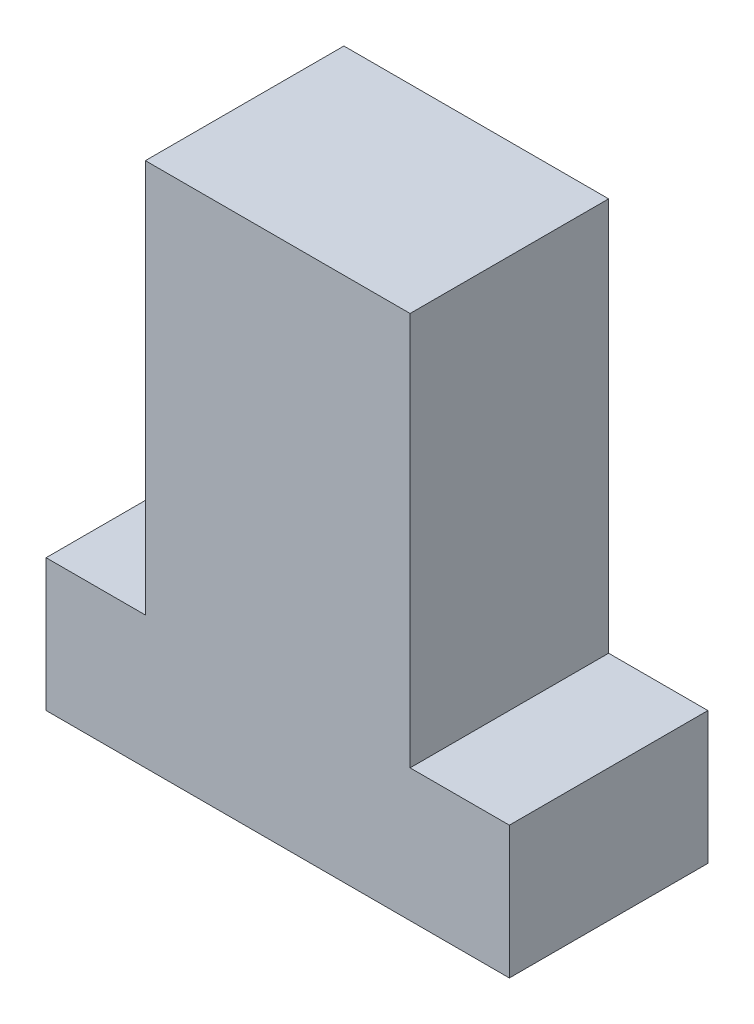
ISO-10303-21;
HEADER;
FILE_DESCRIPTION(('STEP AP214'),'2;1');
FILE_NAME('part.step','',(''),(''),'','','');
FILE_SCHEMA(('AUTOMOTIVE_DESIGN { 1 0 10303 214 1 1 1 1 }'));
ENDSEC;
DATA;
#1=APPLICATION_CONTEXT('core data for automotive mechanical design processes');
#2=APPLICATION_PROTOCOL_DEFINITION('international standard','automotive_design',2000,#1);
#3=PRODUCT_CONTEXT('',#1,'mechanical');
#4=PRODUCT('Part','Part','',(#3));
#5=PRODUCT_RELATED_PRODUCT_CATEGORY('part','',(#4));
#6=PRODUCT_DEFINITION_FORMATION('','',#4);
#7=PRODUCT_DEFINITION_CONTEXT('part definition',#1,'design');
#8=PRODUCT_DEFINITION('design','',#6,#7);
#9=PRODUCT_DEFINITION_SHAPE('','',#8);
#10=(LENGTH_UNIT() NAMED_UNIT(*) SI_UNIT(.MILLI.,.METRE.));
#11=(NAMED_UNIT(*) PLANE_ANGLE_UNIT() SI_UNIT($,.RADIAN.));
#12=(NAMED_UNIT(*) SI_UNIT($,.STERADIAN.) SOLID_ANGLE_UNIT());
#13=UNCERTAINTY_MEASURE_WITH_UNIT(LENGTH_MEASURE(1.E-05),#10,'distance_accuracy_value','');
#14=(GEOMETRIC_REPRESENTATION_CONTEXT(3) GLOBAL_UNCERTAINTY_ASSIGNED_CONTEXT((#13)) GLOBAL_UNIT_ASSIGNED_CONTEXT((#10,
#11,#12)) REPRESENTATION_CONTEXT('',''));
#15=CARTESIAN_POINT('',(0.,0.,0.));
#16=DIRECTION('',(0.,0.,1.));
#17=DIRECTION('',(1.,0.,0.));
#18=AXIS2_PLACEMENT_3D('',#15,#16,#17);
#19=CARTESIAN_POINT('',(-20.,0.,30.));
#20=DIRECTION('',(-1.,0.,0.));
#21=DIRECTION('',(0.,0.,1.));
#22=AXIS2_PLACEMENT_3D('',#19,#20,#21);
#23=PLANE('',#22);
#24=DIRECTION('',(0.,1.,0.));
#25=VECTOR('',#24,1.);
#26=CARTESIAN_POINT('',(-20.,0.,0.));
#27=LINE('',#26,#25);
#28=CARTESIAN_POINT('',(-20.,9.99999999999999,0.));
#29=VERTEX_POINT('',#28);
#30=CARTESIAN_POINT('',(-20.,69.46,0.));
#31=VERTEX_POINT('',#30);
#32=EDGE_CURVE('E181',#29,#31,#27,.T.);
#33=ORIENTED_EDGE('',*,*,#32,.F.);
#34=DIRECTION('',(0.,0.,-1.));
#35=VECTOR('',#34,1.);
#36=CARTESIAN_POINT('',(-20.,9.99999999999999,30.));
#37=LINE('',#36,#35);
#38=CARTESIAN_POINT('',(-20.,9.99999999999999,30.));
#39=VERTEX_POINT('',#38);
#40=EDGE_CURVE('E11',#39,#29,#37,.T.);
#41=ORIENTED_EDGE('',*,*,#40,.F.);
#42=DIRECTION('',(0.,1.,0.));
#43=VECTOR('',#42,1.);
#44=CARTESIAN_POINT('',(-20.,0.,30.));
#45=LINE('',#44,#43);
#46=CARTESIAN_POINT('',(-20.,69.46,30.));
#47=VERTEX_POINT('',#46);
#48=EDGE_CURVE('E141',#39,#47,#45,.T.);
#49=ORIENTED_EDGE('',*,*,#48,.T.);
#50=DIRECTION('',(0.,0.,-1.));
#51=VECTOR('',#50,1.);
#52=CARTESIAN_POINT('',(-20.,69.46,30.));
#53=LINE('',#52,#51);
#54=EDGE_CURVE('E56',#47,#31,#53,.T.);
#55=ORIENTED_EDGE('',*,*,#54,.T.);
#56=EDGE_LOOP('',(#33,#41,#49,#55));
#57=FACE_BOUND('',#56,.T.);
#58=ADVANCED_FACE('F39',(#57),#23,.T.);
#59=CARTESIAN_POINT('',(0.,9.99999999999999,30.));
#60=DIRECTION('',(0.,1.,0.));
#61=DIRECTION('',(0.,0.,1.));
#62=AXIS2_PLACEMENT_3D('',#59,#60,#61);
#63=PLANE('',#62);
#64=DIRECTION('',(1.,0.,0.));
#65=VECTOR('',#64,1.);
#66=CARTESIAN_POINT('',(0.,9.99999999999999,0.));
#67=LINE('',#66,#65);
#68=CARTESIAN_POINT('',(-35.,9.99999999999999,0.));
#69=VERTEX_POINT('',#68);
#70=EDGE_CURVE('E178',#69,#29,#67,.T.);
#71=ORIENTED_EDGE('',*,*,#70,.F.);
#72=DIRECTION('',(0.,0.,-1.));
#73=VECTOR('',#72,1.);
#74=CARTESIAN_POINT('',(-35.,9.99999999999999,30.));
#75=LINE('',#74,#73);
#76=CARTESIAN_POINT('',(-35.,9.99999999999999,30.));
#77=VERTEX_POINT('',#76);
#78=EDGE_CURVE('E48',#77,#69,#75,.T.);
#79=ORIENTED_EDGE('',*,*,#78,.F.);
#80=DIRECTION('',(1.,0.,0.));
#81=VECTOR('',#80,1.);
#82=CARTESIAN_POINT('',(0.,9.99999999999999,30.));
#83=LINE('',#82,#81);
#84=EDGE_CURVE('E132',#77,#39,#83,.T.);
#85=ORIENTED_EDGE('',*,*,#84,.T.);
#86=ORIENTED_EDGE('',*,*,#40,.T.);
#87=EDGE_LOOP('',(#71,#79,#85,#86));
#88=FACE_BOUND('',#87,.T.);
#89=ADVANCED_FACE('F179',(#88),#63,.T.);
#90=CARTESIAN_POINT('',(-35.,0.,30.));
#91=DIRECTION('',(-1.,0.,0.));
#92=DIRECTION('',(0.,0.,1.));
#93=AXIS2_PLACEMENT_3D('',#90,#91,#92);
#94=PLANE('',#93);
#95=DIRECTION('',(0.,1.,0.));
#96=VECTOR('',#95,1.);
#97=CARTESIAN_POINT('',(-35.,0.,0.));
#98=LINE('',#97,#96);
#99=CARTESIAN_POINT('',(-35.,-10.,0.));
#100=VERTEX_POINT('',#99);
#101=EDGE_CURVE('E175',#100,#69,#98,.T.);
#102=ORIENTED_EDGE('',*,*,#101,.F.);
#103=DIRECTION('',(0.,0.,-1.));
#104=VECTOR('',#103,1.);
#105=CARTESIAN_POINT('',(-35.,-10.,30.));
#106=LINE('',#105,#104);
#107=CARTESIAN_POINT('',(-35.,-10.,30.));
#108=VERTEX_POINT('',#107);
#109=EDGE_CURVE('E167',#108,#100,#106,.T.);
#110=ORIENTED_EDGE('',*,*,#109,.F.);
#111=DIRECTION('',(0.,1.,0.));
#112=VECTOR('',#111,1.);
#113=CARTESIAN_POINT('',(-35.,0.,30.));
#114=LINE('',#113,#112);
#115=EDGE_CURVE('E140',#108,#77,#114,.T.);
#116=ORIENTED_EDGE('',*,*,#115,.T.);
#117=ORIENTED_EDGE('',*,*,#78,.T.);
#118=EDGE_LOOP('',(#102,#110,#116,#117));
#119=FACE_BOUND('',#118,.T.);
#120=ADVANCED_FACE('F173',(#119),#94,.T.);
#121=CARTESIAN_POINT('',(0.,-10.,30.));
#122=DIRECTION('',(0.,1.,0.));
#123=DIRECTION('',(0.,0.,1.));
#124=AXIS2_PLACEMENT_3D('',#121,#122,#123);
#125=PLANE('',#124);
#126=DIRECTION('',(1.,0.,0.));
#127=VECTOR('',#126,1.);
#128=CARTESIAN_POINT('',(0.,-10.,0.));
#129=LINE('',#128,#127);
#130=CARTESIAN_POINT('',(35.,-10.,0.));
#131=VERTEX_POINT('',#130);
#132=EDGE_CURVE('E186',#100,#131,#129,.T.);
#133=ORIENTED_EDGE('',*,*,#132,.T.);
#134=DIRECTION('',(0.,0.,-1.));
#135=VECTOR('',#134,1.);
#136=CARTESIAN_POINT('',(35.,-10.,30.));
#137=LINE('',#136,#135);
#138=CARTESIAN_POINT('',(35.,-10.,30.));
#139=VERTEX_POINT('',#138);
#140=EDGE_CURVE('E163',#139,#131,#137,.T.);
#141=ORIENTED_EDGE('',*,*,#140,.F.);
#142=DIRECTION('',(1.,0.,0.));
#143=VECTOR('',#142,1.);
#144=CARTESIAN_POINT('',(0.,-10.,30.));
#145=LINE('',#144,#143);
#146=EDGE_CURVE('E134',#108,#139,#145,.T.);
#147=ORIENTED_EDGE('',*,*,#146,.F.);
#148=ORIENTED_EDGE('',*,*,#109,.T.);
#149=EDGE_LOOP('',(#133,#141,#147,#148));
#150=FACE_BOUND('',#149,.T.);
#151=ADVANCED_FACE('F201',(#150),#125,.F.);
#152=CARTESIAN_POINT('',(35.,0.,30.));
#153=DIRECTION('',(-1.,0.,0.));
#154=DIRECTION('',(0.,0.,1.));
#155=AXIS2_PLACEMENT_3D('',#152,#153,#154);
#156=PLANE('',#155);
#157=DIRECTION('',(0.,1.,0.));
#158=VECTOR('',#157,1.);
#159=CARTESIAN_POINT('',(35.,0.,0.));
#160=LINE('',#159,#158);
#161=CARTESIAN_POINT('',(35.,9.99999999999999,0.));
#162=VERTEX_POINT('',#161);
#163=EDGE_CURVE('E190',#131,#162,#160,.T.);
#164=ORIENTED_EDGE('',*,*,#163,.T.);
#165=DIRECTION('',(0.,0.,-1.));
#166=VECTOR('',#165,1.);
#167=CARTESIAN_POINT('',(35.,9.99999999999999,30.));
#168=LINE('',#167,#166);
#169=CARTESIAN_POINT('',(35.,9.99999999999999,30.));
#170=VERTEX_POINT('',#169);
#171=EDGE_CURVE('E117',#170,#162,#168,.T.);
#172=ORIENTED_EDGE('',*,*,#171,.F.);
#173=DIRECTION('',(0.,1.,0.));
#174=VECTOR('',#173,1.);
#175=CARTESIAN_POINT('',(35.,0.,30.));
#176=LINE('',#175,#174);
#177=EDGE_CURVE('E128',#139,#170,#176,.T.);
#178=ORIENTED_EDGE('',*,*,#177,.F.);
#179=ORIENTED_EDGE('',*,*,#140,.T.);
#180=EDGE_LOOP('',(#164,#172,#178,#179));
#181=FACE_BOUND('',#180,.T.);
#182=ADVANCED_FACE('F197',(#181),#156,.F.);
#183=CARTESIAN_POINT('',(20.,9.99999999999999,0.));
#184=VERTEX_POINT('',#183);
#185=EDGE_CURVE('E113',#184,#162,#67,.T.);
#186=ORIENTED_EDGE('',*,*,#185,.F.);
#187=DIRECTION('',(0.,0.,-1.));
#188=VECTOR('',#187,1.);
#189=CARTESIAN_POINT('',(20.,9.99999999999999,30.));
#190=LINE('',#189,#188);
#191=CARTESIAN_POINT('',(20.,9.99999999999999,30.));
#192=VERTEX_POINT('',#191);
#193=EDGE_CURVE('E107',#192,#184,#190,.T.);
#194=ORIENTED_EDGE('',*,*,#193,.F.);
#195=EDGE_CURVE('E111',#192,#170,#83,.T.);
#196=ORIENTED_EDGE('',*,*,#195,.T.);
#197=ORIENTED_EDGE('',*,*,#171,.T.);
#198=EDGE_LOOP('',(#186,#194,#196,#197));
#199=FACE_BOUND('',#198,.T.);
#200=ADVANCED_FACE('F109',(#199),#63,.T.);
#201=CARTESIAN_POINT('',(20.,0.,30.));
#202=DIRECTION('',(-1.,0.,0.));
#203=DIRECTION('',(0.,0.,1.));
#204=AXIS2_PLACEMENT_3D('',#201,#202,#203);
#205=PLANE('',#204);
#206=DIRECTION('',(0.,1.,0.));
#207=VECTOR('',#206,1.);
#208=CARTESIAN_POINT('',(20.,0.,0.));
#209=LINE('',#208,#207);
#210=CARTESIAN_POINT('',(20.,69.46,0.));
#211=VERTEX_POINT('',#210);
#212=EDGE_CURVE('E150',#184,#211,#209,.T.);
#213=ORIENTED_EDGE('',*,*,#212,.T.);
#214=DIRECTION('',(0.,0.,-1.));
#215=VECTOR('',#214,1.);
#216=CARTESIAN_POINT('',(20.,69.46,30.));
#217=LINE('',#216,#215);
#218=CARTESIAN_POINT('',(20.,69.46,30.));
#219=VERTEX_POINT('',#218);
#220=EDGE_CURVE('E82',#219,#211,#217,.T.);
#221=ORIENTED_EDGE('',*,*,#220,.F.);
#222=DIRECTION('',(0.,1.,0.));
#223=VECTOR('',#222,1.);
#224=CARTESIAN_POINT('',(20.,0.,30.));
#225=LINE('',#224,#223);
#226=EDGE_CURVE('E119',#192,#219,#225,.T.);
#227=ORIENTED_EDGE('',*,*,#226,.F.);
#228=ORIENTED_EDGE('',*,*,#193,.T.);
#229=EDGE_LOOP('',(#213,#221,#227,#228));
#230=FACE_BOUND('',#229,.T.);
#231=ADVANCED_FACE('F120',(#230),#205,.F.);
#232=CARTESIAN_POINT('',(0.,69.46,30.));
#233=DIRECTION('',(0.,1.,0.));
#234=DIRECTION('',(0.,0.,1.));
#235=AXIS2_PLACEMENT_3D('',#232,#233,#234);
#236=PLANE('',#235);
#237=DIRECTION('',(1.,0.,0.));
#238=VECTOR('',#237,1.);
#239=CARTESIAN_POINT('',(0.,69.46,0.));
#240=LINE('',#239,#238);
#241=EDGE_CURVE('E147',#31,#211,#240,.T.);
#242=ORIENTED_EDGE('',*,*,#241,.F.);
#243=ORIENTED_EDGE('',*,*,#54,.F.);
#244=DIRECTION('',(1.,0.,0.));
#245=VECTOR('',#244,1.);
#246=CARTESIAN_POINT('',(0.,69.46,30.));
#247=LINE('',#246,#245);
#248=EDGE_CURVE('E124',#47,#219,#247,.T.);
#249=ORIENTED_EDGE('',*,*,#248,.T.);
#250=ORIENTED_EDGE('',*,*,#220,.T.);
#251=EDGE_LOOP('',(#242,#243,#249,#250));
#252=FACE_BOUND('',#251,.T.);
#253=ADVANCED_FACE('F207',(#252),#236,.T.);
#254=CARTESIAN_POINT('',(0.,0.,30.));
#255=DIRECTION('',(0.,0.,1.));
#256=DIRECTION('',(1.,0.,0.));
#257=AXIS2_PLACEMENT_3D('',#254,#255,#256);
#258=PLANE('',#257);
#259=ORIENTED_EDGE('',*,*,#48,.F.);
#260=ORIENTED_EDGE('',*,*,#84,.F.);
#261=ORIENTED_EDGE('',*,*,#115,.F.);
#262=ORIENTED_EDGE('',*,*,#146,.T.);
#263=ORIENTED_EDGE('',*,*,#177,.T.);
#264=ORIENTED_EDGE('',*,*,#195,.F.);
#265=ORIENTED_EDGE('',*,*,#226,.T.);
#266=ORIENTED_EDGE('',*,*,#248,.F.);
#267=EDGE_LOOP('',(#259,#260,#261,#262,#263,#264,#265,#266));
#268=FACE_BOUND('',#267,.T.);
#269=ADVANCED_FACE('F126',(#268),#258,.T.);
#270=CARTESIAN_POINT('',(0.,0.,0.));
#271=DIRECTION('',(0.,0.,1.));
#272=DIRECTION('',(1.,0.,0.));
#273=AXIS2_PLACEMENT_3D('',#270,#271,#272);
#274=PLANE('',#273);
#275=ORIENTED_EDGE('',*,*,#32,.T.);
#276=ORIENTED_EDGE('',*,*,#241,.T.);
#277=ORIENTED_EDGE('',*,*,#212,.F.);
#278=ORIENTED_EDGE('',*,*,#185,.T.);
#279=ORIENTED_EDGE('',*,*,#163,.F.);
#280=ORIENTED_EDGE('',*,*,#132,.F.);
#281=ORIENTED_EDGE('',*,*,#101,.T.);
#282=ORIENTED_EDGE('',*,*,#70,.T.);
#283=EDGE_LOOP('',(#275,#276,#277,#278,#279,#280,#281,#282));
#284=FACE_BOUND('',#283,.T.);
#285=ADVANCED_FACE('F184',(#284),#274,.F.);
#286=CLOSED_SHELL('',(#58,#89,#120,#151,#182,#200,#231,#253,#269,#285));
#287=MANIFOLD_SOLID_BREP('B2',#286);
#288=ADVANCED_BREP_SHAPE_REPRESENTATION('',(#18,#287),#14);
#289=SHAPE_DEFINITION_REPRESENTATION(#9,#288);
ENDSEC;
END-ISO-10303-21;
